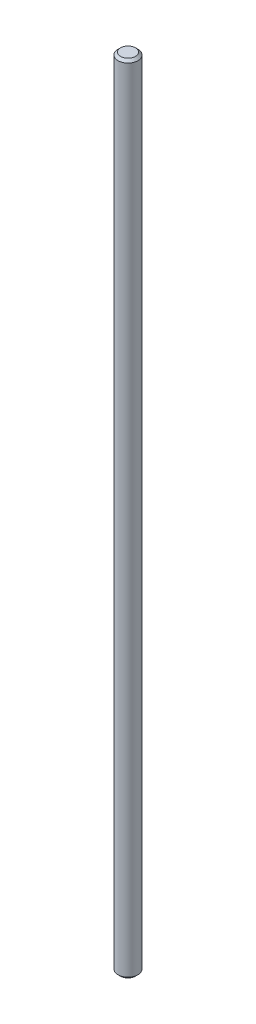
ISO-10303-21;
HEADER;
FILE_DESCRIPTION(('STEP AP214'),'2;1');
FILE_NAME('part.step','',(''),(''),'','','');
FILE_SCHEMA(('AUTOMOTIVE_DESIGN { 1 0 10303 214 1 1 1 1 }'));
ENDSEC;
DATA;
#1=APPLICATION_CONTEXT('core data for automotive mechanical design processes');
#2=APPLICATION_PROTOCOL_DEFINITION('international standard','automotive_design',2000,#1);
#3=PRODUCT_CONTEXT('',#1,'mechanical');
#4=PRODUCT('Part','Part','',(#3));
#5=PRODUCT_RELATED_PRODUCT_CATEGORY('part','',(#4));
#6=PRODUCT_DEFINITION_FORMATION('','',#4);
#7=PRODUCT_DEFINITION_CONTEXT('part definition',#1,'design');
#8=PRODUCT_DEFINITION('design','',#6,#7);
#9=PRODUCT_DEFINITION_SHAPE('','',#8);
#10=(LENGTH_UNIT() NAMED_UNIT(*) SI_UNIT(.MILLI.,.METRE.));
#11=(NAMED_UNIT(*) PLANE_ANGLE_UNIT() SI_UNIT($,.RADIAN.));
#12=(NAMED_UNIT(*) SI_UNIT($,.STERADIAN.) SOLID_ANGLE_UNIT());
#13=UNCERTAINTY_MEASURE_WITH_UNIT(LENGTH_MEASURE(1.E-05),#10,'distance_accuracy_value','');
#14=(GEOMETRIC_REPRESENTATION_CONTEXT(3) GLOBAL_UNCERTAINTY_ASSIGNED_CONTEXT((#13)) GLOBAL_UNIT_ASSIGNED_CONTEXT((#10,
#11,#12)) REPRESENTATION_CONTEXT('',''));
#15=CARTESIAN_POINT('',(0.,0.,0.));
#16=DIRECTION('',(0.,0.,1.));
#17=DIRECTION('',(1.,0.,0.));
#18=AXIS2_PLACEMENT_3D('',#15,#16,#17);
#19=CARTESIAN_POINT('',(0.,160.,0.));
#20=DIRECTION('',(0.,-1.,0.));
#21=DIRECTION('',(0.,0.,-1.));
#22=AXIS2_PLACEMENT_3D('',#19,#20,#21);
#23=CYLINDRICAL_SURFACE('',#22,2.);
#24=CARTESIAN_POINT('',(0.,0.499999999999973,0.));
#25=DIRECTION('',(0.,1.,0.));
#26=DIRECTION('',(0.,0.,1.));
#27=AXIS2_PLACEMENT_3D('',#24,#25,#26);
#28=CIRCLE('',#27,2.);
#29=CARTESIAN_POINT('',(0.,0.499999999999973,2.));
#30=VERTEX_POINT('',#29);
#31=EDGE_CURVE('E46',#30,#30,#28,.T.);
#32=ORIENTED_EDGE('',*,*,#31,.T.);
#33=EDGE_LOOP('',(#32));
#34=FACE_BOUND('',#33,.T.);
#35=CARTESIAN_POINT('',(0.,159.5,0.));
#36=DIRECTION('',(0.,1.,0.));
#37=DIRECTION('',(0.,0.,1.));
#38=AXIS2_PLACEMENT_3D('',#35,#36,#37);
#39=CIRCLE('',#38,2.);
#40=CARTESIAN_POINT('',(0.,159.5,2.));
#41=VERTEX_POINT('',#40);
#42=EDGE_CURVE('E50',#41,#41,#39,.F.);
#43=ORIENTED_EDGE('',*,*,#42,.T.);
#44=EDGE_LOOP('',(#43));
#45=FACE_BOUND('',#44,.T.);
#46=ADVANCED_FACE('F34',(#34,#45),#23,.T.);
#47=CARTESIAN_POINT('',(0.,160.,0.));
#48=DIRECTION('',(0.,1.,0.));
#49=DIRECTION('',(0.,0.,1.));
#50=AXIS2_PLACEMENT_3D('',#47,#48,#49);
#51=PLANE('',#50);
#52=CARTESIAN_POINT('',(0.,160.,0.));
#53=DIRECTION('',(0.,1.,0.));
#54=DIRECTION('',(0.,0.,1.));
#55=AXIS2_PLACEMENT_3D('',#52,#53,#54);
#56=CIRCLE('',#55,1.5);
#57=CARTESIAN_POINT('',(0.,160.,1.5));
#58=VERTEX_POINT('',#57);
#59=EDGE_CURVE('E10',#58,#58,#56,.T.);
#60=ORIENTED_EDGE('',*,*,#59,.T.);
#61=EDGE_LOOP('',(#60));
#62=FACE_BOUND('',#61,.T.);
#63=ADVANCED_FACE('F66',(#62),#51,.T.);
#64=CARTESIAN_POINT('',(0.,0.,0.));
#65=DIRECTION('',(0.,1.,0.));
#66=DIRECTION('',(0.,0.,1.));
#67=AXIS2_PLACEMENT_3D('',#64,#65,#66);
#68=PLANE('',#67);
#69=CARTESIAN_POINT('',(0.,0.,0.));
#70=DIRECTION('',(0.,1.,0.));
#71=DIRECTION('',(0.,0.,1.));
#72=AXIS2_PLACEMENT_3D('',#69,#70,#71);
#73=CIRCLE('',#72,1.50000000000002);
#74=CARTESIAN_POINT('',(0.,0.,1.50000000000002));
#75=VERTEX_POINT('',#74);
#76=EDGE_CURVE('E42',#75,#75,#73,.F.);
#77=ORIENTED_EDGE('',*,*,#76,.T.);
#78=EDGE_LOOP('',(#77));
#79=FACE_BOUND('',#78,.T.);
#80=ADVANCED_FACE('F63',(#79),#68,.F.);
#81=CARTESIAN_POINT('',(0.,0.499999999999973,0.));
#82=DIRECTION('',(0.,1.,0.));
#83=DIRECTION('',(0.,0.,1.));
#84=AXIS2_PLACEMENT_3D('',#81,#82,#83);
#85=CONICAL_SURFACE('',#84,2.,0.78539816339746);
#86=ORIENTED_EDGE('',*,*,#76,.F.);
#87=EDGE_LOOP('',(#86));
#88=FACE_BOUND('',#87,.T.);
#89=ORIENTED_EDGE('',*,*,#31,.F.);
#90=EDGE_LOOP('',(#89));
#91=FACE_BOUND('',#90,.T.);
#92=ADVANCED_FACE('F59',(#88,#91),#85,.T.);
#93=CARTESIAN_POINT('',(0.,160.,0.));
#94=DIRECTION('',(0.,-1.,0.));
#95=DIRECTION('',(0.,0.,-1.));
#96=AXIS2_PLACEMENT_3D('',#93,#94,#95);
#97=CONICAL_SURFACE('',#96,1.5,0.785398163397419);
#98=ORIENTED_EDGE('',*,*,#42,.F.);
#99=EDGE_LOOP('',(#98));
#100=FACE_BOUND('',#99,.T.);
#101=ORIENTED_EDGE('',*,*,#59,.F.);
#102=EDGE_LOOP('',(#101));
#103=FACE_BOUND('',#102,.T.);
#104=ADVANCED_FACE('F37',(#100,#103),#97,.T.);
#105=CLOSED_SHELL('',(#46,#63,#80,#92,#104));
#106=MANIFOLD_SOLID_BREP('B2',#105);
#107=ADVANCED_BREP_SHAPE_REPRESENTATION('',(#18,#106),#14);
#108=SHAPE_DEFINITION_REPRESENTATION(#9,#107);
ENDSEC;
END-ISO-10303-21;
